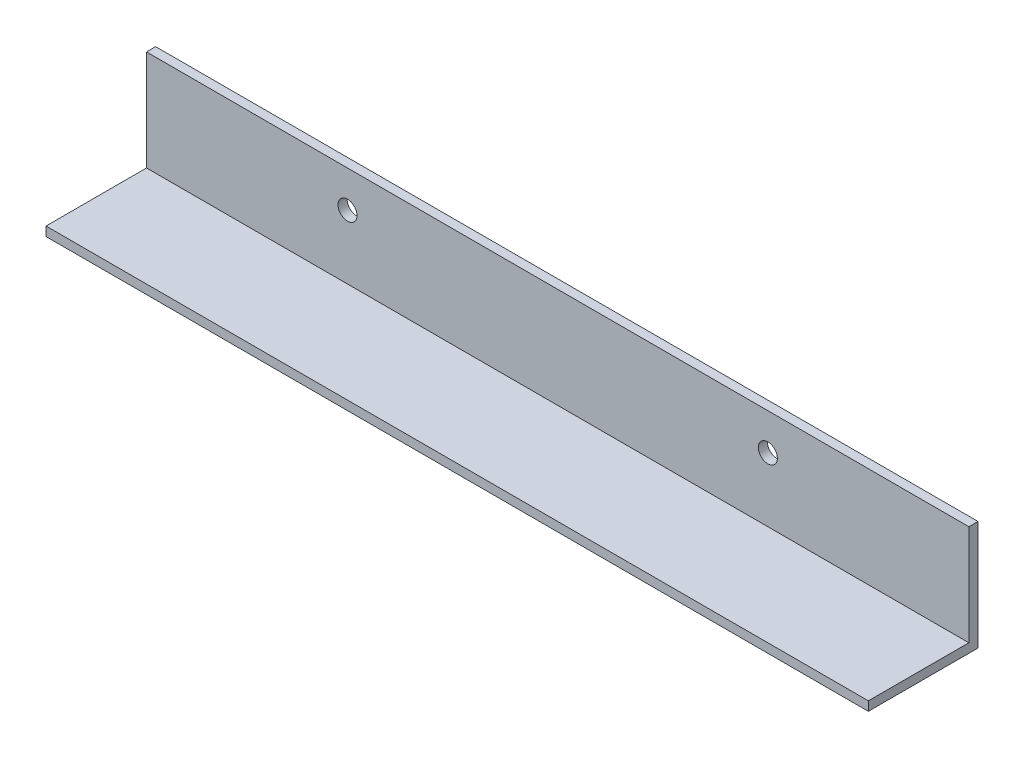
ISO-10303-21;
HEADER;
FILE_DESCRIPTION(('STEP AP214'),'2;1');
FILE_NAME('part.step','',(''),(''),'','','');
FILE_SCHEMA(('AUTOMOTIVE_DESIGN { 1 0 10303 214 1 1 1 1 }'));
ENDSEC;
DATA;
#1=APPLICATION_CONTEXT('core data for automotive mechanical design processes');
#2=APPLICATION_PROTOCOL_DEFINITION('international standard','automotive_design',2000,#1);
#3=PRODUCT_CONTEXT('',#1,'mechanical');
#4=PRODUCT('Part','Part','',(#3));
#5=PRODUCT_RELATED_PRODUCT_CATEGORY('part','',(#4));
#6=PRODUCT_DEFINITION_FORMATION('','',#4);
#7=PRODUCT_DEFINITION_CONTEXT('part definition',#1,'design');
#8=PRODUCT_DEFINITION('design','',#6,#7);
#9=PRODUCT_DEFINITION_SHAPE('','',#8);
#10=(LENGTH_UNIT() NAMED_UNIT(*) SI_UNIT(.MILLI.,.METRE.));
#11=(NAMED_UNIT(*) PLANE_ANGLE_UNIT() SI_UNIT($,.RADIAN.));
#12=(NAMED_UNIT(*) SI_UNIT($,.STERADIAN.) SOLID_ANGLE_UNIT());
#13=UNCERTAINTY_MEASURE_WITH_UNIT(LENGTH_MEASURE(1.E-05),#10,'distance_accuracy_value','');
#14=(GEOMETRIC_REPRESENTATION_CONTEXT(3) GLOBAL_UNCERTAINTY_ASSIGNED_CONTEXT((#13)) GLOBAL_UNIT_ASSIGNED_CONTEXT((#10,
#11,#12)) REPRESENTATION_CONTEXT('',''));
#15=CARTESIAN_POINT('',(0.,0.,0.));
#16=DIRECTION('',(0.,0.,1.));
#17=DIRECTION('',(1.,0.,0.));
#18=AXIS2_PLACEMENT_3D('',#15,#16,#17);
#19=CARTESIAN_POINT('',(73.025,25.4,0.));
#20=DIRECTION('',(0.,0.,1.));
#21=DIRECTION('',(1.,0.,0.));
#22=AXIS2_PLACEMENT_3D('',#19,#20,#21);
#23=CYLINDRICAL_SURFACE('',#22,3.302);
#24=CARTESIAN_POINT('',(73.025,25.4,3.175));
#25=DIRECTION('',(0.,0.,1.));
#26=DIRECTION('',(1.,0.,0.));
#27=AXIS2_PLACEMENT_3D('',#24,#25,#26);
#28=CIRCLE('',#27,3.302);
#29=CARTESIAN_POINT('',(76.327,25.4,3.175));
#30=VERTEX_POINT('',#29);
#31=EDGE_CURVE('E20',#30,#30,#28,.F.);
#32=ORIENTED_EDGE('',*,*,#31,.F.);
#33=EDGE_LOOP('',(#32));
#34=FACE_BOUND('',#33,.T.);
#35=CARTESIAN_POINT('',(73.025,25.4,0.));
#36=DIRECTION('',(0.,0.,1.));
#37=DIRECTION('',(1.,0.,0.));
#38=AXIS2_PLACEMENT_3D('',#35,#36,#37);
#39=CIRCLE('',#38,3.302);
#40=CARTESIAN_POINT('',(76.327,25.4,0.));
#41=VERTEX_POINT('',#40);
#42=EDGE_CURVE('E95',#41,#41,#39,.T.);
#43=ORIENTED_EDGE('',*,*,#42,.F.);
#44=EDGE_LOOP('',(#43));
#45=FACE_BOUND('',#44,.T.);
#46=ADVANCED_FACE('F17',(#34,#45),#23,.F.);
#47=CARTESIAN_POINT('',(-73.025,25.4,0.));
#48=DIRECTION('',(0.,0.,1.));
#49=DIRECTION('',(1.,0.,0.));
#50=AXIS2_PLACEMENT_3D('',#47,#48,#49);
#51=CYLINDRICAL_SURFACE('',#50,3.302);
#52=CARTESIAN_POINT('',(-73.025,25.4,0.));
#53=DIRECTION('',(0.,0.,1.));
#54=DIRECTION('',(1.,0.,0.));
#55=AXIS2_PLACEMENT_3D('',#52,#53,#54);
#56=CIRCLE('',#55,3.302);
#57=CARTESIAN_POINT('',(-69.723,25.4,0.));
#58=VERTEX_POINT('',#57);
#59=EDGE_CURVE('E92',#58,#58,#56,.T.);
#60=ORIENTED_EDGE('',*,*,#59,.F.);
#61=EDGE_LOOP('',(#60));
#62=FACE_BOUND('',#61,.T.);
#63=CARTESIAN_POINT('',(-73.025,25.4,3.175));
#64=DIRECTION('',(0.,0.,1.));
#65=DIRECTION('',(1.,0.,0.));
#66=AXIS2_PLACEMENT_3D('',#63,#64,#65);
#67=CIRCLE('',#66,3.302);
#68=CARTESIAN_POINT('',(-69.723,25.4,3.175));
#69=VERTEX_POINT('',#68);
#70=EDGE_CURVE('E101',#69,#69,#67,.F.);
#71=ORIENTED_EDGE('',*,*,#70,.F.);
#72=EDGE_LOOP('',(#71));
#73=FACE_BOUND('',#72,.T.);
#74=ADVANCED_FACE('F113',(#62,#73),#51,.F.);
#75=CARTESIAN_POINT('',(-142.875,38.1,0.));
#76=DIRECTION('',(0.,1.,0.));
#77=DIRECTION('',(0.,0.,1.));
#78=AXIS2_PLACEMENT_3D('',#75,#76,#77);
#79=PLANE('',#78);
#80=DIRECTION('',(-1.,0.,0.));
#81=VECTOR('',#80,1.);
#82=CARTESIAN_POINT('',(-142.875,38.1,0.));
#83=LINE('',#82,#81);
#84=CARTESIAN_POINT('',(-142.875,38.1,0.));
#85=VERTEX_POINT('',#84);
#86=CARTESIAN_POINT('',(142.875,38.1,0.));
#87=VERTEX_POINT('',#86);
#88=EDGE_CURVE('E99',#85,#87,#83,.F.);
#89=ORIENTED_EDGE('',*,*,#88,.F.);
#90=DIRECTION('',(0.,0.,-1.));
#91=VECTOR('',#90,1.);
#92=CARTESIAN_POINT('',(-142.875,38.1,0.));
#93=LINE('',#92,#91);
#94=CARTESIAN_POINT('',(-142.875,38.1,3.175));
#95=VERTEX_POINT('',#94);
#96=EDGE_CURVE('E75',#85,#95,#93,.F.);
#97=ORIENTED_EDGE('',*,*,#96,.T.);
#98=DIRECTION('',(1.,0.,0.));
#99=VECTOR('',#98,1.);
#100=CARTESIAN_POINT('',(-142.875,38.1,3.175));
#101=LINE('',#100,#99);
#102=CARTESIAN_POINT('',(142.875,38.1,3.175));
#103=VERTEX_POINT('',#102);
#104=EDGE_CURVE('E71',#103,#95,#101,.F.);
#105=ORIENTED_EDGE('',*,*,#104,.F.);
#106=DIRECTION('',(0.,0.,-1.));
#107=VECTOR('',#106,1.);
#108=CARTESIAN_POINT('',(142.875,38.1,0.));
#109=LINE('',#108,#107);
#110=EDGE_CURVE('E68',#87,#103,#109,.F.);
#111=ORIENTED_EDGE('',*,*,#110,.F.);
#112=EDGE_LOOP('',(#89,#97,#105,#111));
#113=FACE_BOUND('',#112,.T.);
#114=ADVANCED_FACE('F73',(#113),#79,.T.);
#115=CARTESIAN_POINT('',(-142.875,38.1,3.175));
#116=DIRECTION('',(0.,0.,1.));
#117=DIRECTION('',(1.,0.,0.));
#118=AXIS2_PLACEMENT_3D('',#115,#116,#117);
#119=PLANE('',#118);
#120=ORIENTED_EDGE('',*,*,#70,.T.);
#121=EDGE_LOOP('',(#120));
#122=FACE_BOUND('',#121,.T.);
#123=ORIENTED_EDGE('',*,*,#31,.T.);
#124=EDGE_LOOP('',(#123));
#125=FACE_BOUND('',#124,.T.);
#126=ORIENTED_EDGE('',*,*,#104,.T.);
#127=DIRECTION('',(0.,1.,0.));
#128=VECTOR('',#127,1.);
#129=CARTESIAN_POINT('',(-142.875,0.,3.175));
#130=LINE('',#129,#128);
#131=CARTESIAN_POINT('',(-142.875,3.175,3.175));
#132=VERTEX_POINT('',#131);
#133=EDGE_CURVE('E144',#95,#132,#130,.F.);
#134=ORIENTED_EDGE('',*,*,#133,.T.);
#135=DIRECTION('',(1.,0.,0.));
#136=VECTOR('',#135,1.);
#137=CARTESIAN_POINT('',(-142.875,3.175,3.175));
#138=LINE('',#137,#136);
#139=CARTESIAN_POINT('',(142.875,3.175,3.175));
#140=VERTEX_POINT('',#139);
#141=EDGE_CURVE('E83',#140,#132,#138,.F.);
#142=ORIENTED_EDGE('',*,*,#141,.F.);
#143=DIRECTION('',(0.,1.,0.));
#144=VECTOR('',#143,1.);
#145=CARTESIAN_POINT('',(142.875,0.,3.175));
#146=LINE('',#145,#144);
#147=EDGE_CURVE('E80',#103,#140,#146,.F.);
#148=ORIENTED_EDGE('',*,*,#147,.F.);
#149=EDGE_LOOP('',(#126,#134,#142,#148));
#150=FACE_BOUND('',#149,.T.);
#151=ADVANCED_FACE('F81',(#122,#125,#150),#119,.T.);
#152=CARTESIAN_POINT('',(-142.875,3.175,3.175));
#153=DIRECTION('',(0.,1.,0.));
#154=DIRECTION('',(0.,0.,1.));
#155=AXIS2_PLACEMENT_3D('',#152,#153,#154);
#156=PLANE('',#155);
#157=ORIENTED_EDGE('',*,*,#141,.T.);
#158=DIRECTION('',(0.,0.,-1.));
#159=VECTOR('',#158,1.);
#160=CARTESIAN_POINT('',(-142.875,3.175,0.));
#161=LINE('',#160,#159);
#162=CARTESIAN_POINT('',(-142.875,3.175,38.1));
#163=VERTEX_POINT('',#162);
#164=EDGE_CURVE('E142',#132,#163,#161,.F.);
#165=ORIENTED_EDGE('',*,*,#164,.T.);
#166=DIRECTION('',(1.,0.,0.));
#167=VECTOR('',#166,1.);
#168=CARTESIAN_POINT('',(-142.875,3.175,38.1));
#169=LINE('',#168,#167);
#170=CARTESIAN_POINT('',(142.875,3.175,38.1));
#171=VERTEX_POINT('',#170);
#172=EDGE_CURVE('E134',#171,#163,#169,.F.);
#173=ORIENTED_EDGE('',*,*,#172,.F.);
#174=DIRECTION('',(0.,0.,-1.));
#175=VECTOR('',#174,1.);
#176=CARTESIAN_POINT('',(142.875,3.175,0.));
#177=LINE('',#176,#175);
#178=EDGE_CURVE('E86',#140,#171,#177,.F.);
#179=ORIENTED_EDGE('',*,*,#178,.F.);
#180=EDGE_LOOP('',(#157,#165,#173,#179));
#181=FACE_BOUND('',#180,.T.);
#182=ADVANCED_FACE('F119',(#181),#156,.T.);
#183=CARTESIAN_POINT('',(-142.875,0.,0.));
#184=DIRECTION('',(0.,0.,-1.));
#185=DIRECTION('',(-1.,0.,0.));
#186=AXIS2_PLACEMENT_3D('',#183,#184,#185);
#187=PLANE('',#186);
#188=ORIENTED_EDGE('',*,*,#59,.T.);
#189=EDGE_LOOP('',(#188));
#190=FACE_BOUND('',#189,.T.);
#191=ORIENTED_EDGE('',*,*,#42,.T.);
#192=EDGE_LOOP('',(#191));
#193=FACE_BOUND('',#192,.T.);
#194=DIRECTION('',(1.,0.,0.));
#195=VECTOR('',#194,1.);
#196=CARTESIAN_POINT('',(-142.875,0.,0.));
#197=LINE('',#196,#195);
#198=CARTESIAN_POINT('',(-142.875,0.,0.));
#199=VERTEX_POINT('',#198);
#200=CARTESIAN_POINT('',(142.875,0.,0.));
#201=VERTEX_POINT('',#200);
#202=EDGE_CURVE('E124',#199,#201,#197,.T.);
#203=ORIENTED_EDGE('',*,*,#202,.F.);
#204=DIRECTION('',(0.,1.,0.));
#205=VECTOR('',#204,1.);
#206=CARTESIAN_POINT('',(-142.875,0.,0.));
#207=LINE('',#206,#205);
#208=EDGE_CURVE('E126',#199,#85,#207,.T.);
#209=ORIENTED_EDGE('',*,*,#208,.T.);
#210=ORIENTED_EDGE('',*,*,#88,.T.);
#211=DIRECTION('',(0.,1.,0.));
#212=VECTOR('',#211,1.);
#213=CARTESIAN_POINT('',(142.875,0.,0.));
#214=LINE('',#213,#212);
#215=EDGE_CURVE('E91',#201,#87,#214,.T.);
#216=ORIENTED_EDGE('',*,*,#215,.F.);
#217=EDGE_LOOP('',(#203,#209,#210,#216));
#218=FACE_BOUND('',#217,.T.);
#219=ADVANCED_FACE('F116',(#190,#193,#218),#187,.T.);
#220=CARTESIAN_POINT('',(142.875,0.,0.));
#221=DIRECTION('',(1.,0.,0.));
#222=DIRECTION('',(0.,0.,-1.));
#223=AXIS2_PLACEMENT_3D('',#220,#221,#222);
#224=PLANE('',#223);
#225=DIRECTION('',(0.,0.,-1.));
#226=VECTOR('',#225,1.);
#227=CARTESIAN_POINT('',(142.875,0.,38.1));
#228=LINE('',#227,#226);
#229=CARTESIAN_POINT('',(142.875,0.,38.1));
#230=VERTEX_POINT('',#229);
#231=EDGE_CURVE('E129',#201,#230,#228,.F.);
#232=ORIENTED_EDGE('',*,*,#231,.F.);
#233=ORIENTED_EDGE('',*,*,#215,.T.);
#234=ORIENTED_EDGE('',*,*,#110,.T.);
#235=ORIENTED_EDGE('',*,*,#147,.T.);
#236=ORIENTED_EDGE('',*,*,#178,.T.);
#237=DIRECTION('',(0.,1.,0.));
#238=VECTOR('',#237,1.);
#239=CARTESIAN_POINT('',(142.875,3.175,38.1));
#240=LINE('',#239,#238);
#241=EDGE_CURVE('E148',#230,#171,#240,.T.);
#242=ORIENTED_EDGE('',*,*,#241,.F.);
#243=EDGE_LOOP('',(#232,#233,#234,#235,#236,#242));
#244=FACE_BOUND('',#243,.T.);
#245=ADVANCED_FACE('F90',(#244),#224,.T.);
#246=CARTESIAN_POINT('',(-142.875,3.175,38.1));
#247=DIRECTION('',(0.,0.,1.));
#248=DIRECTION('',(1.,0.,0.));
#249=AXIS2_PLACEMENT_3D('',#246,#247,#248);
#250=PLANE('',#249);
#251=ORIENTED_EDGE('',*,*,#172,.T.);
#252=DIRECTION('',(0.,1.,0.));
#253=VECTOR('',#252,1.);
#254=CARTESIAN_POINT('',(-142.875,0.,38.1));
#255=LINE('',#254,#253);
#256=CARTESIAN_POINT('',(-142.875,0.,38.1));
#257=VERTEX_POINT('',#256);
#258=EDGE_CURVE('E35',#163,#257,#255,.F.);
#259=ORIENTED_EDGE('',*,*,#258,.T.);
#260=DIRECTION('',(1.,0.,0.));
#261=VECTOR('',#260,1.);
#262=CARTESIAN_POINT('',(-142.875,0.,38.1));
#263=LINE('',#262,#261);
#264=EDGE_CURVE('E26',#230,#257,#263,.F.);
#265=ORIENTED_EDGE('',*,*,#264,.F.);
#266=ORIENTED_EDGE('',*,*,#241,.T.);
#267=EDGE_LOOP('',(#251,#259,#265,#266));
#268=FACE_BOUND('',#267,.T.);
#269=ADVANCED_FACE('F153',(#268),#250,.T.);
#270=CARTESIAN_POINT('',(-142.875,0.,0.));
#271=DIRECTION('',(1.,0.,0.));
#272=DIRECTION('',(0.,0.,-1.));
#273=AXIS2_PLACEMENT_3D('',#270,#271,#272);
#274=PLANE('',#273);
#275=ORIENTED_EDGE('',*,*,#258,.F.);
#276=ORIENTED_EDGE('',*,*,#164,.F.);
#277=ORIENTED_EDGE('',*,*,#133,.F.);
#278=ORIENTED_EDGE('',*,*,#96,.F.);
#279=ORIENTED_EDGE('',*,*,#208,.F.);
#280=DIRECTION('',(0.,0.,-1.));
#281=VECTOR('',#280,1.);
#282=CARTESIAN_POINT('',(-142.875,0.,38.1));
#283=LINE('',#282,#281);
#284=EDGE_CURVE('E11',#257,#199,#283,.T.);
#285=ORIENTED_EDGE('',*,*,#284,.F.);
#286=EDGE_LOOP('',(#275,#276,#277,#278,#279,#285));
#287=FACE_BOUND('',#286,.T.);
#288=ADVANCED_FACE('F132',(#287),#274,.F.);
#289=CARTESIAN_POINT('',(-142.875,0.,38.1));
#290=DIRECTION('',(0.,-1.,0.));
#291=DIRECTION('',(0.,0.,-1.));
#292=AXIS2_PLACEMENT_3D('',#289,#290,#291);
#293=PLANE('',#292);
#294=ORIENTED_EDGE('',*,*,#264,.T.);
#295=ORIENTED_EDGE('',*,*,#284,.T.);
#296=ORIENTED_EDGE('',*,*,#202,.T.);
#297=ORIENTED_EDGE('',*,*,#231,.T.);
#298=EDGE_LOOP('',(#294,#295,#296,#297));
#299=FACE_BOUND('',#298,.T.);
#300=ADVANCED_FACE('F136',(#299),#293,.T.);
#301=CLOSED_SHELL('',(#46,#74,#114,#151,#182,#219,#245,#269,#288,#300));
#302=MANIFOLD_SOLID_BREP('B1',#301);
#303=ADVANCED_BREP_SHAPE_REPRESENTATION('',(#18,#302),#14);
#304=SHAPE_DEFINITION_REPRESENTATION(#9,#303);
ENDSEC;
END-ISO-10303-21;
